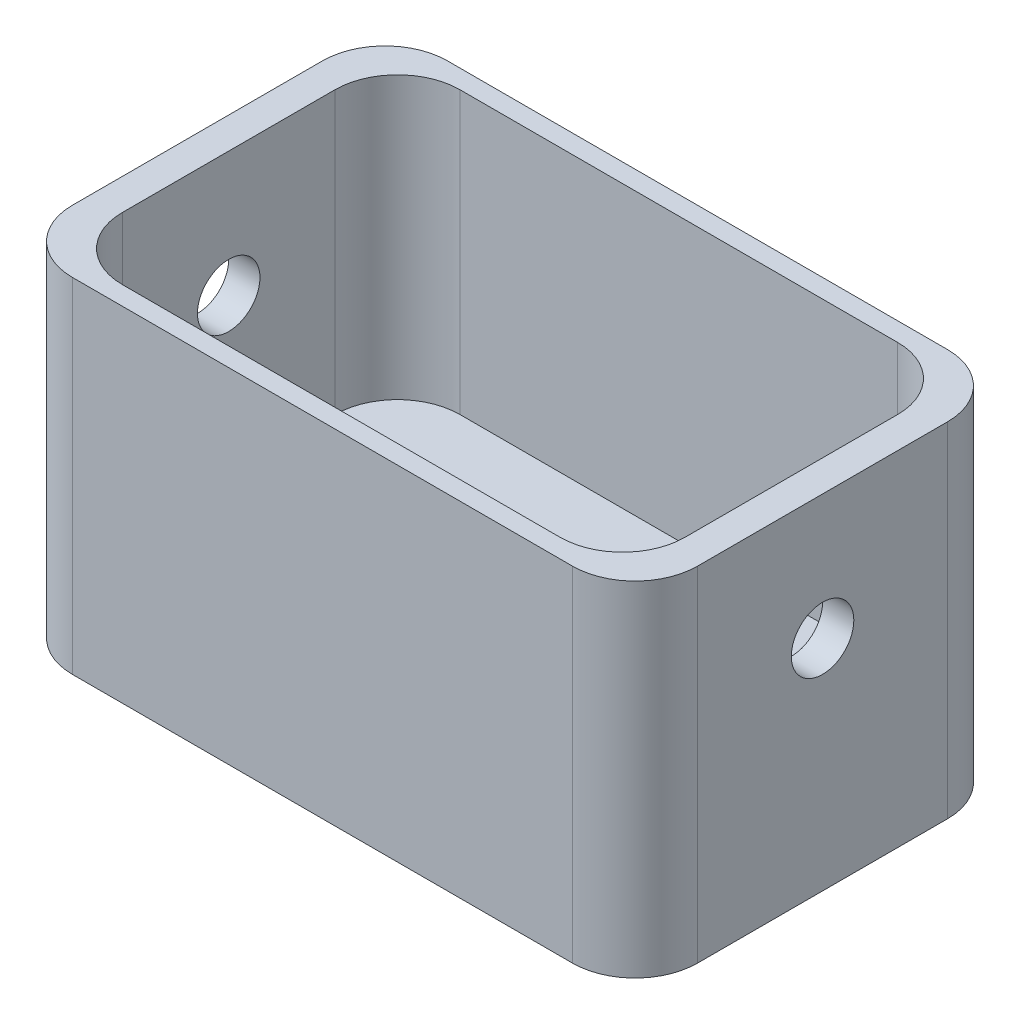
ISO-10303-21;
HEADER;
FILE_DESCRIPTION(('STEP AP214'),'2;1');
FILE_NAME('part.step','',(''),(''),'','','');
FILE_SCHEMA(('AUTOMOTIVE_DESIGN { 1 0 10303 214 1 1 1 1 }'));
ENDSEC;
DATA;
#1=APPLICATION_CONTEXT('core data for automotive mechanical design processes');
#2=APPLICATION_PROTOCOL_DEFINITION('international standard','automotive_design',2000,#1);
#3=PRODUCT_CONTEXT('',#1,'mechanical');
#4=PRODUCT('Part','Part','',(#3));
#5=PRODUCT_RELATED_PRODUCT_CATEGORY('part','',(#4));
#6=PRODUCT_DEFINITION_FORMATION('','',#4);
#7=PRODUCT_DEFINITION_CONTEXT('part definition',#1,'design');
#8=PRODUCT_DEFINITION('design','',#6,#7);
#9=PRODUCT_DEFINITION_SHAPE('','',#8);
#10=(LENGTH_UNIT() NAMED_UNIT(*) SI_UNIT(.MILLI.,.METRE.));
#11=(NAMED_UNIT(*) PLANE_ANGLE_UNIT() SI_UNIT($,.RADIAN.));
#12=(NAMED_UNIT(*) SI_UNIT($,.STERADIAN.) SOLID_ANGLE_UNIT());
#13=UNCERTAINTY_MEASURE_WITH_UNIT(LENGTH_MEASURE(1.E-05),#10,'distance_accuracy_value','');
#14=(GEOMETRIC_REPRESENTATION_CONTEXT(3) GLOBAL_UNCERTAINTY_ASSIGNED_CONTEXT((#13)) GLOBAL_UNIT_ASSIGNED_CONTEXT((#10,
#11,#12)) REPRESENTATION_CONTEXT('',''));
#15=CARTESIAN_POINT('',(0.,0.,0.));
#16=DIRECTION('',(0.,0.,1.));
#17=DIRECTION('',(1.,0.,0.));
#18=AXIS2_PLACEMENT_3D('',#15,#16,#17);
#19=CARTESIAN_POINT('',(-50.,55.,30.));
#20=DIRECTION('',(1.,0.,0.));
#21=DIRECTION('',(0.,0.,-1.));
#22=AXIS2_PLACEMENT_3D('',#19,#20,#21);
#23=PLANE('',#22);
#24=CARTESIAN_POINT('',(-50.,35.,0.));
#25=DIRECTION('',(1.,0.,0.));
#26=DIRECTION('',(0.,0.,-1.));
#27=AXIS2_PLACEMENT_3D('',#24,#25,#26);
#28=CIRCLE('',#27,5.);
#29=CARTESIAN_POINT('',(-50.,35.,-5.));
#30=VERTEX_POINT('',#29);
#31=EDGE_CURVE('E210',#30,#30,#28,.T.);
#32=ORIENTED_EDGE('',*,*,#31,.T.);
#33=EDGE_LOOP('',(#32));
#34=FACE_BOUND('',#33,.T.);
#35=DIRECTION('',(0.,0.,1.));
#36=VECTOR('',#35,1.);
#37=CARTESIAN_POINT('',(-50.,0.,30.));
#38=LINE('',#37,#36);
#39=CARTESIAN_POINT('',(-50.,0.,-20.));
#40=VERTEX_POINT('',#39);
#41=CARTESIAN_POINT('',(-50.,0.,20.));
#42=VERTEX_POINT('',#41);
#43=EDGE_CURVE('E196',#40,#42,#38,.T.);
#44=ORIENTED_EDGE('',*,*,#43,.T.);
#45=DIRECTION('',(0.,-1.,0.));
#46=VECTOR('',#45,1.);
#47=CARTESIAN_POINT('',(-50.,55.,20.));
#48=LINE('',#47,#46);
#49=CARTESIAN_POINT('',(-50.,55.,20.));
#50=VERTEX_POINT('',#49);
#51=EDGE_CURVE('E261',#42,#50,#48,.F.);
#52=ORIENTED_EDGE('',*,*,#51,.T.);
#53=DIRECTION('',(0.,0.,1.));
#54=VECTOR('',#53,1.);
#55=CARTESIAN_POINT('',(-50.,55.,30.));
#56=LINE('',#55,#54);
#57=CARTESIAN_POINT('',(-50.,55.,-20.));
#58=VERTEX_POINT('',#57);
#59=EDGE_CURVE('E185',#58,#50,#56,.T.);
#60=ORIENTED_EDGE('',*,*,#59,.F.);
#61=DIRECTION('',(0.,-1.,0.));
#62=VECTOR('',#61,1.);
#63=CARTESIAN_POINT('',(-50.,55.,-20.));
#64=LINE('',#63,#62);
#65=EDGE_CURVE('E258',#58,#40,#64,.T.);
#66=ORIENTED_EDGE('',*,*,#65,.T.);
#67=EDGE_LOOP('',(#44,#52,#60,#66));
#68=FACE_BOUND('',#67,.T.);
#69=ADVANCED_FACE('F33',(#34,#68),#23,.F.);
#70=CARTESIAN_POINT('',(50.,55.,30.));
#71=DIRECTION('',(0.,0.,-1.));
#72=DIRECTION('',(-1.,0.,0.));
#73=AXIS2_PLACEMENT_3D('',#70,#71,#72);
#74=PLANE('',#73);
#75=DIRECTION('',(1.,0.,0.));
#76=VECTOR('',#75,1.);
#77=CARTESIAN_POINT('',(50.,0.,30.));
#78=LINE('',#77,#76);
#79=CARTESIAN_POINT('',(-40.,0.,30.));
#80=VERTEX_POINT('',#79);
#81=CARTESIAN_POINT('',(40.,0.,30.));
#82=VERTEX_POINT('',#81);
#83=EDGE_CURVE('E199',#80,#82,#78,.T.);
#84=ORIENTED_EDGE('',*,*,#83,.T.);
#85=DIRECTION('',(0.,-1.,0.));
#86=VECTOR('',#85,1.);
#87=CARTESIAN_POINT('',(40.,55.,30.));
#88=LINE('',#87,#86);
#89=CARTESIAN_POINT('',(40.,55.,30.));
#90=VERTEX_POINT('',#89);
#91=EDGE_CURVE('E249',#82,#90,#88,.F.);
#92=ORIENTED_EDGE('',*,*,#91,.T.);
#93=DIRECTION('',(1.,0.,0.));
#94=VECTOR('',#93,1.);
#95=CARTESIAN_POINT('',(50.,55.,30.));
#96=LINE('',#95,#94);
#97=CARTESIAN_POINT('',(-40.,55.,30.));
#98=VERTEX_POINT('',#97);
#99=EDGE_CURVE('E188',#98,#90,#96,.T.);
#100=ORIENTED_EDGE('',*,*,#99,.F.);
#101=DIRECTION('',(0.,-1.,0.));
#102=VECTOR('',#101,1.);
#103=CARTESIAN_POINT('',(-40.,55.,30.));
#104=LINE('',#103,#102);
#105=EDGE_CURVE('E246',#98,#80,#104,.T.);
#106=ORIENTED_EDGE('',*,*,#105,.T.);
#107=EDGE_LOOP('',(#84,#92,#100,#106));
#108=FACE_BOUND('',#107,.T.);
#109=ADVANCED_FACE('F330',(#108),#74,.F.);
#110=CARTESIAN_POINT('',(50.,55.,30.));
#111=DIRECTION('',(-1.,0.,0.));
#112=DIRECTION('',(0.,0.,1.));
#113=AXIS2_PLACEMENT_3D('',#110,#111,#112);
#114=PLANE('',#113);
#115=CARTESIAN_POINT('',(50.,35.,0.));
#116=DIRECTION('',(1.,0.,0.));
#117=DIRECTION('',(0.,0.,-1.));
#118=AXIS2_PLACEMENT_3D('',#115,#116,#117);
#119=CIRCLE('',#118,5.);
#120=CARTESIAN_POINT('',(50.,35.,-5.));
#121=VERTEX_POINT('',#120);
#122=EDGE_CURVE('E294',#121,#121,#119,.T.);
#123=ORIENTED_EDGE('',*,*,#122,.F.);
#124=EDGE_LOOP('',(#123));
#125=FACE_BOUND('',#124,.T.);
#126=DIRECTION('',(0.,0.,-1.));
#127=VECTOR('',#126,1.);
#128=CARTESIAN_POINT('',(50.,55.,30.));
#129=LINE('',#128,#127);
#130=CARTESIAN_POINT('',(50.,55.,20.));
#131=VERTEX_POINT('',#130);
#132=CARTESIAN_POINT('',(50.,55.,-20.));
#133=VERTEX_POINT('',#132);
#134=EDGE_CURVE('E192',#131,#133,#129,.T.);
#135=ORIENTED_EDGE('',*,*,#134,.F.);
#136=DIRECTION('',(0.,-1.,0.));
#137=VECTOR('',#136,1.);
#138=CARTESIAN_POINT('',(50.,55.,20.));
#139=LINE('',#138,#137);
#140=CARTESIAN_POINT('',(50.,0.,20.));
#141=VERTEX_POINT('',#140);
#142=EDGE_CURVE('E235',#131,#141,#139,.T.);
#143=ORIENTED_EDGE('',*,*,#142,.T.);
#144=DIRECTION('',(0.,0.,-1.));
#145=VECTOR('',#144,1.);
#146=CARTESIAN_POINT('',(50.,0.,30.));
#147=LINE('',#146,#145);
#148=CARTESIAN_POINT('',(50.,0.,-20.));
#149=VERTEX_POINT('',#148);
#150=EDGE_CURVE('E203',#141,#149,#147,.T.);
#151=ORIENTED_EDGE('',*,*,#150,.T.);
#152=DIRECTION('',(0.,-1.,0.));
#153=VECTOR('',#152,1.);
#154=CARTESIAN_POINT('',(50.,55.,-20.));
#155=LINE('',#154,#153);
#156=EDGE_CURVE('E233',#149,#133,#155,.F.);
#157=ORIENTED_EDGE('',*,*,#156,.T.);
#158=EDGE_LOOP('',(#135,#143,#151,#157));
#159=FACE_BOUND('',#158,.T.);
#160=ADVANCED_FACE('F335',(#125,#159),#114,.F.);
#161=CARTESIAN_POINT('',(50.,55.,-30.));
#162=DIRECTION('',(0.,0.,1.));
#163=DIRECTION('',(1.,0.,0.));
#164=AXIS2_PLACEMENT_3D('',#161,#162,#163);
#165=PLANE('',#164);
#166=DIRECTION('',(-1.,0.,0.));
#167=VECTOR('',#166,1.);
#168=CARTESIAN_POINT('',(50.,0.,-30.));
#169=LINE('',#168,#167);
#170=CARTESIAN_POINT('',(40.,0.,-30.));
#171=VERTEX_POINT('',#170);
#172=CARTESIAN_POINT('',(-40.,0.,-30.));
#173=VERTEX_POINT('',#172);
#174=EDGE_CURVE('E189',#171,#173,#169,.T.);
#175=ORIENTED_EDGE('',*,*,#174,.T.);
#176=DIRECTION('',(0.,-1.,0.));
#177=VECTOR('',#176,1.);
#178=CARTESIAN_POINT('',(-40.,55.,-30.));
#179=LINE('',#178,#177);
#180=CARTESIAN_POINT('',(-40.,55.,-30.));
#181=VERTEX_POINT('',#180);
#182=EDGE_CURVE('E48',#173,#181,#179,.F.);
#183=ORIENTED_EDGE('',*,*,#182,.T.);
#184=DIRECTION('',(-1.,0.,0.));
#185=VECTOR('',#184,1.);
#186=CARTESIAN_POINT('',(50.,55.,-30.));
#187=LINE('',#186,#185);
#188=CARTESIAN_POINT('',(40.,55.,-30.));
#189=VERTEX_POINT('',#188);
#190=EDGE_CURVE('E194',#189,#181,#187,.T.);
#191=ORIENTED_EDGE('',*,*,#190,.F.);
#192=DIRECTION('',(0.,-1.,0.));
#193=VECTOR('',#192,1.);
#194=CARTESIAN_POINT('',(40.,55.,-30.));
#195=LINE('',#194,#193);
#196=EDGE_CURVE('E263',#189,#171,#195,.T.);
#197=ORIENTED_EDGE('',*,*,#196,.T.);
#198=EDGE_LOOP('',(#175,#183,#191,#197));
#199=FACE_BOUND('',#198,.T.);
#200=ADVANCED_FACE('F341',(#199),#165,.F.);
#201=CARTESIAN_POINT('',(0.,55.,0.));
#202=DIRECTION('',(0.,1.,0.));
#203=DIRECTION('',(0.,0.,1.));
#204=AXIS2_PLACEMENT_3D('',#201,#202,#203);
#205=PLANE('',#204);
#206=DIRECTION('',(0.,0.,1.));
#207=VECTOR('',#206,1.);
#208=CARTESIAN_POINT('',(-45.,55.,-27.));
#209=LINE('',#208,#207);
#210=CARTESIAN_POINT('',(-45.,55.,-17.));
#211=VERTEX_POINT('',#210);
#212=CARTESIAN_POINT('',(-45.,55.,17.));
#213=VERTEX_POINT('',#212);
#214=EDGE_CURVE('E173',#211,#213,#209,.T.);
#215=ORIENTED_EDGE('',*,*,#214,.F.);
#216=CARTESIAN_POINT('',(-35.,55.,-17.));
#217=DIRECTION('',(0.,1.,0.));
#218=DIRECTION('',(0.,0.,1.));
#219=AXIS2_PLACEMENT_3D('',#216,#217,#218);
#220=CIRCLE('',#219,10.);
#221=CARTESIAN_POINT('',(-35.,55.,-27.));
#222=VERTEX_POINT('',#221);
#223=EDGE_CURVE('E11',#211,#222,#220,.F.);
#224=ORIENTED_EDGE('',*,*,#223,.T.);
#225=DIRECTION('',(-1.,0.,0.));
#226=VECTOR('',#225,1.);
#227=CARTESIAN_POINT('',(45.,55.,-27.));
#228=LINE('',#227,#226);
#229=CARTESIAN_POINT('',(35.,55.,-27.));
#230=VERTEX_POINT('',#229);
#231=EDGE_CURVE('E176',#230,#222,#228,.T.);
#232=ORIENTED_EDGE('',*,*,#231,.F.);
#233=CARTESIAN_POINT('',(35.,55.,-17.));
#234=DIRECTION('',(0.,1.,0.));
#235=DIRECTION('',(0.,0.,1.));
#236=AXIS2_PLACEMENT_3D('',#233,#234,#235);
#237=CIRCLE('',#236,10.);
#238=CARTESIAN_POINT('',(45.,55.,-17.));
#239=VERTEX_POINT('',#238);
#240=EDGE_CURVE('E41',#230,#239,#237,.F.);
#241=ORIENTED_EDGE('',*,*,#240,.T.);
#242=DIRECTION('',(0.,0.,-1.));
#243=VECTOR('',#242,1.);
#244=CARTESIAN_POINT('',(45.,55.,-27.));
#245=LINE('',#244,#243);
#246=CARTESIAN_POINT('',(45.,55.,17.));
#247=VERTEX_POINT('',#246);
#248=EDGE_CURVE('E172',#247,#239,#245,.T.);
#249=ORIENTED_EDGE('',*,*,#248,.F.);
#250=CARTESIAN_POINT('',(35.,55.,17.));
#251=DIRECTION('',(0.,1.,0.));
#252=DIRECTION('',(0.,0.,1.));
#253=AXIS2_PLACEMENT_3D('',#250,#251,#252);
#254=CIRCLE('',#253,10.);
#255=CARTESIAN_POINT('',(35.,55.,27.));
#256=VERTEX_POINT('',#255);
#257=EDGE_CURVE('E157',#247,#256,#254,.F.);
#258=ORIENTED_EDGE('',*,*,#257,.T.);
#259=DIRECTION('',(1.,0.,0.));
#260=VECTOR('',#259,1.);
#261=CARTESIAN_POINT('',(45.,55.,27.));
#262=LINE('',#261,#260);
#263=CARTESIAN_POINT('',(-35.,55.,27.));
#264=VERTEX_POINT('',#263);
#265=EDGE_CURVE('E163',#264,#256,#262,.T.);
#266=ORIENTED_EDGE('',*,*,#265,.F.);
#267=CARTESIAN_POINT('',(-35.,55.,17.));
#268=DIRECTION('',(0.,1.,0.));
#269=DIRECTION('',(0.,0.,1.));
#270=AXIS2_PLACEMENT_3D('',#267,#268,#269);
#271=CIRCLE('',#270,10.);
#272=EDGE_CURVE('E147',#264,#213,#271,.F.);
#273=ORIENTED_EDGE('',*,*,#272,.T.);
#274=EDGE_LOOP('',(#215,#224,#232,#241,#249,#258,#266,#273));
#275=FACE_BOUND('',#274,.T.);
#276=ORIENTED_EDGE('',*,*,#99,.T.);
#277=CARTESIAN_POINT('',(40.,55.,20.));
#278=DIRECTION('',(0.,1.,0.));
#279=DIRECTION('',(0.,0.,1.));
#280=AXIS2_PLACEMENT_3D('',#277,#278,#279);
#281=CIRCLE('',#280,10.);
#282=EDGE_CURVE('E256',#90,#131,#281,.T.);
#283=ORIENTED_EDGE('',*,*,#282,.T.);
#284=ORIENTED_EDGE('',*,*,#134,.T.);
#285=CARTESIAN_POINT('',(40.,55.,-20.));
#286=DIRECTION('',(0.,1.,0.));
#287=DIRECTION('',(0.,0.,1.));
#288=AXIS2_PLACEMENT_3D('',#285,#286,#287);
#289=CIRCLE('',#288,10.);
#290=EDGE_CURVE('E55',#133,#189,#289,.T.);
#291=ORIENTED_EDGE('',*,*,#290,.T.);
#292=ORIENTED_EDGE('',*,*,#190,.T.);
#293=CARTESIAN_POINT('',(-40.,55.,-20.));
#294=DIRECTION('',(0.,1.,0.));
#295=DIRECTION('',(0.,0.,1.));
#296=AXIS2_PLACEMENT_3D('',#293,#294,#295);
#297=CIRCLE('',#296,10.);
#298=EDGE_CURVE('E252',#181,#58,#297,.T.);
#299=ORIENTED_EDGE('',*,*,#298,.T.);
#300=ORIENTED_EDGE('',*,*,#59,.T.);
#301=CARTESIAN_POINT('',(-40.,55.,20.));
#302=DIRECTION('',(0.,1.,0.));
#303=DIRECTION('',(0.,0.,1.));
#304=AXIS2_PLACEMENT_3D('',#301,#302,#303);
#305=CIRCLE('',#304,10.);
#306=EDGE_CURVE('E254',#50,#98,#305,.T.);
#307=ORIENTED_EDGE('',*,*,#306,.T.);
#308=EDGE_LOOP('',(#276,#283,#284,#291,#292,#299,#300,#307));
#309=FACE_BOUND('',#308,.T.);
#310=ADVANCED_FACE('F170',(#275,#309),#205,.T.);
#311=CARTESIAN_POINT('',(0.,0.,0.));
#312=DIRECTION('',(0.,1.,0.));
#313=DIRECTION('',(0.,0.,1.));
#314=AXIS2_PLACEMENT_3D('',#311,#312,#313);
#315=PLANE('',#314);
#316=ORIENTED_EDGE('',*,*,#150,.F.);
#317=CARTESIAN_POINT('',(40.,0.,20.));
#318=DIRECTION('',(0.,1.,0.));
#319=DIRECTION('',(0.,0.,1.));
#320=AXIS2_PLACEMENT_3D('',#317,#318,#319);
#321=CIRCLE('',#320,10.);
#322=EDGE_CURVE('E244',#141,#82,#321,.F.);
#323=ORIENTED_EDGE('',*,*,#322,.T.);
#324=ORIENTED_EDGE('',*,*,#83,.F.);
#325=CARTESIAN_POINT('',(-40.,0.,20.));
#326=DIRECTION('',(0.,1.,0.));
#327=DIRECTION('',(0.,0.,1.));
#328=AXIS2_PLACEMENT_3D('',#325,#326,#327);
#329=CIRCLE('',#328,10.);
#330=EDGE_CURVE('E242',#80,#42,#329,.F.);
#331=ORIENTED_EDGE('',*,*,#330,.T.);
#332=ORIENTED_EDGE('',*,*,#43,.F.);
#333=CARTESIAN_POINT('',(-40.,0.,-20.));
#334=DIRECTION('',(0.,1.,0.));
#335=DIRECTION('',(0.,0.,1.));
#336=AXIS2_PLACEMENT_3D('',#333,#334,#335);
#337=CIRCLE('',#336,10.);
#338=EDGE_CURVE('E240',#40,#173,#337,.F.);
#339=ORIENTED_EDGE('',*,*,#338,.T.);
#340=ORIENTED_EDGE('',*,*,#174,.F.);
#341=CARTESIAN_POINT('',(40.,0.,-20.));
#342=DIRECTION('',(0.,1.,0.));
#343=DIRECTION('',(0.,0.,1.));
#344=AXIS2_PLACEMENT_3D('',#341,#342,#343);
#345=CIRCLE('',#344,10.);
#346=EDGE_CURVE('E238',#171,#149,#345,.F.);
#347=ORIENTED_EDGE('',*,*,#346,.T.);
#348=EDGE_LOOP('',(#316,#323,#324,#331,#332,#339,#340,#347));
#349=FACE_BOUND('',#348,.T.);
#350=ADVANCED_FACE('F312',(#349),#315,.F.);
#351=CARTESIAN_POINT('',(-45.,10.,-27.));
#352=DIRECTION('',(-1.,0.,0.));
#353=DIRECTION('',(0.,0.,1.));
#354=AXIS2_PLACEMENT_3D('',#351,#352,#353);
#355=PLANE('',#354);
#356=CARTESIAN_POINT('',(-45.,35.,0.));
#357=DIRECTION('',(-1.,0.,0.));
#358=DIRECTION('',(0.,0.,1.));
#359=AXIS2_PLACEMENT_3D('',#356,#357,#358);
#360=CIRCLE('',#359,5.);
#361=CARTESIAN_POINT('',(-45.,35.,5.));
#362=VERTEX_POINT('',#361);
#363=EDGE_CURVE('E178',#362,#362,#360,.T.);
#364=ORIENTED_EDGE('',*,*,#363,.T.);
#365=EDGE_LOOP('',(#364));
#366=FACE_BOUND('',#365,.T.);
#367=ORIENTED_EDGE('',*,*,#214,.T.);
#368=DIRECTION('',(0.,1.,0.));
#369=VECTOR('',#368,1.);
#370=CARTESIAN_POINT('',(-45.,10.,17.));
#371=LINE('',#370,#369);
#372=CARTESIAN_POINT('',(-45.,10.,17.));
#373=VERTEX_POINT('',#372);
#374=EDGE_CURVE('E152',#213,#373,#371,.F.);
#375=ORIENTED_EDGE('',*,*,#374,.T.);
#376=DIRECTION('',(0.,0.,1.));
#377=VECTOR('',#376,1.);
#378=CARTESIAN_POINT('',(-45.,10.,-27.));
#379=LINE('',#378,#377);
#380=CARTESIAN_POINT('',(-45.,10.,-17.));
#381=VERTEX_POINT('',#380);
#382=EDGE_CURVE('E184',#381,#373,#379,.T.);
#383=ORIENTED_EDGE('',*,*,#382,.F.);
#384=DIRECTION('',(0.,1.,0.));
#385=VECTOR('',#384,1.);
#386=CARTESIAN_POINT('',(-45.,55.,-17.));
#387=LINE('',#386,#385);
#388=EDGE_CURVE('E167',#381,#211,#387,.T.);
#389=ORIENTED_EDGE('',*,*,#388,.T.);
#390=EDGE_LOOP('',(#367,#375,#383,#389));
#391=FACE_BOUND('',#390,.T.);
#392=ADVANCED_FACE('F309',(#366,#391),#355,.F.);
#393=CARTESIAN_POINT('',(45.,10.,-27.));
#394=DIRECTION('',(0.,0.,-1.));
#395=DIRECTION('',(-1.,0.,0.));
#396=AXIS2_PLACEMENT_3D('',#393,#394,#395);
#397=PLANE('',#396);
#398=DIRECTION('',(-1.,0.,0.));
#399=VECTOR('',#398,1.);
#400=CARTESIAN_POINT('',(45.,10.,-27.));
#401=LINE('',#400,#399);
#402=CARTESIAN_POINT('',(35.,10.,-27.));
#403=VERTEX_POINT('',#402);
#404=CARTESIAN_POINT('',(-35.,10.,-27.));
#405=VERTEX_POINT('',#404);
#406=EDGE_CURVE('E200',#403,#405,#401,.T.);
#407=ORIENTED_EDGE('',*,*,#406,.F.);
#408=DIRECTION('',(0.,1.,0.));
#409=VECTOR('',#408,1.);
#410=CARTESIAN_POINT('',(35.,55.,-27.));
#411=LINE('',#410,#409);
#412=EDGE_CURVE('E230',#403,#230,#411,.T.);
#413=ORIENTED_EDGE('',*,*,#412,.T.);
#414=ORIENTED_EDGE('',*,*,#231,.T.);
#415=DIRECTION('',(0.,1.,0.));
#416=VECTOR('',#415,1.);
#417=CARTESIAN_POINT('',(-35.,10.,-27.));
#418=LINE('',#417,#416);
#419=EDGE_CURVE('E228',#222,#405,#418,.F.);
#420=ORIENTED_EDGE('',*,*,#419,.T.);
#421=EDGE_LOOP('',(#407,#413,#414,#420));
#422=FACE_BOUND('',#421,.T.);
#423=ADVANCED_FACE('F286',(#422),#397,.F.);
#424=CARTESIAN_POINT('',(45.,10.,-27.));
#425=DIRECTION('',(1.,0.,0.));
#426=DIRECTION('',(0.,0.,-1.));
#427=AXIS2_PLACEMENT_3D('',#424,#425,#426);
#428=PLANE('',#427);
#429=CARTESIAN_POINT('',(45.,35.,0.));
#430=DIRECTION('',(1.,0.,0.));
#431=DIRECTION('',(0.,0.,-1.));
#432=AXIS2_PLACEMENT_3D('',#429,#430,#431);
#433=CIRCLE('',#432,5.);
#434=CARTESIAN_POINT('',(45.,35.,-5.));
#435=VERTEX_POINT('',#434);
#436=EDGE_CURVE('E207',#435,#435,#433,.T.);
#437=ORIENTED_EDGE('',*,*,#436,.T.);
#438=EDGE_LOOP('',(#437));
#439=FACE_BOUND('',#438,.T.);
#440=DIRECTION('',(0.,0.,-1.));
#441=VECTOR('',#440,1.);
#442=CARTESIAN_POINT('',(45.,10.,-27.));
#443=LINE('',#442,#441);
#444=CARTESIAN_POINT('',(45.,10.,17.));
#445=VERTEX_POINT('',#444);
#446=CARTESIAN_POINT('',(45.,10.,-17.));
#447=VERTEX_POINT('',#446);
#448=EDGE_CURVE('E284',#445,#447,#443,.T.);
#449=ORIENTED_EDGE('',*,*,#448,.F.);
#450=DIRECTION('',(0.,1.,0.));
#451=VECTOR('',#450,1.);
#452=CARTESIAN_POINT('',(45.,55.,17.));
#453=LINE('',#452,#451);
#454=EDGE_CURVE('E225',#445,#247,#453,.T.);
#455=ORIENTED_EDGE('',*,*,#454,.T.);
#456=ORIENTED_EDGE('',*,*,#248,.T.);
#457=DIRECTION('',(0.,1.,0.));
#458=VECTOR('',#457,1.);
#459=CARTESIAN_POINT('',(45.,10.,-17.));
#460=LINE('',#459,#458);
#461=EDGE_CURVE('E223',#239,#447,#460,.F.);
#462=ORIENTED_EDGE('',*,*,#461,.T.);
#463=EDGE_LOOP('',(#449,#455,#456,#462));
#464=FACE_BOUND('',#463,.T.);
#465=ADVANCED_FACE('F273',(#439,#464),#428,.F.);
#466=CARTESIAN_POINT('',(45.,10.,27.));
#467=DIRECTION('',(0.,0.,1.));
#468=DIRECTION('',(1.,0.,0.));
#469=AXIS2_PLACEMENT_3D('',#466,#467,#468);
#470=PLANE('',#469);
#471=DIRECTION('',(1.,0.,0.));
#472=VECTOR('',#471,1.);
#473=CARTESIAN_POINT('',(45.,10.,27.));
#474=LINE('',#473,#472);
#475=CARTESIAN_POINT('',(-35.,10.,27.));
#476=VERTEX_POINT('',#475);
#477=CARTESIAN_POINT('',(35.,10.,27.));
#478=VERTEX_POINT('',#477);
#479=EDGE_CURVE('E166',#476,#478,#474,.T.);
#480=ORIENTED_EDGE('',*,*,#479,.F.);
#481=DIRECTION('',(0.,1.,0.));
#482=VECTOR('',#481,1.);
#483=CARTESIAN_POINT('',(-35.,55.,27.));
#484=LINE('',#483,#482);
#485=EDGE_CURVE('E151',#476,#264,#484,.T.);
#486=ORIENTED_EDGE('',*,*,#485,.T.);
#487=ORIENTED_EDGE('',*,*,#265,.T.);
#488=DIRECTION('',(0.,1.,0.));
#489=VECTOR('',#488,1.);
#490=CARTESIAN_POINT('',(35.,10.,27.));
#491=LINE('',#490,#489);
#492=EDGE_CURVE('E168',#256,#478,#491,.F.);
#493=ORIENTED_EDGE('',*,*,#492,.T.);
#494=EDGE_LOOP('',(#480,#486,#487,#493));
#495=FACE_BOUND('',#494,.T.);
#496=ADVANCED_FACE('F162',(#495),#470,.F.);
#497=CARTESIAN_POINT('',(0.,10.,0.));
#498=DIRECTION('',(0.,-1.,0.));
#499=DIRECTION('',(0.,0.,-1.));
#500=AXIS2_PLACEMENT_3D('',#497,#498,#499);
#501=PLANE('',#500);
#502=ORIENTED_EDGE('',*,*,#382,.T.);
#503=CARTESIAN_POINT('',(-35.,10.,17.));
#504=DIRECTION('',(0.,-1.,0.));
#505=DIRECTION('',(0.,0.,-1.));
#506=AXIS2_PLACEMENT_3D('',#503,#504,#505);
#507=CIRCLE('',#506,10.);
#508=EDGE_CURVE('E221',#373,#476,#507,.F.);
#509=ORIENTED_EDGE('',*,*,#508,.T.);
#510=ORIENTED_EDGE('',*,*,#479,.T.);
#511=CARTESIAN_POINT('',(35.,10.,17.));
#512=DIRECTION('',(0.,-1.,0.));
#513=DIRECTION('',(0.,0.,-1.));
#514=AXIS2_PLACEMENT_3D('',#511,#512,#513);
#515=CIRCLE('',#514,10.);
#516=EDGE_CURVE('E219',#478,#445,#515,.F.);
#517=ORIENTED_EDGE('',*,*,#516,.T.);
#518=ORIENTED_EDGE('',*,*,#448,.T.);
#519=CARTESIAN_POINT('',(35.,10.,-17.));
#520=DIRECTION('',(0.,-1.,0.));
#521=DIRECTION('',(0.,0.,-1.));
#522=AXIS2_PLACEMENT_3D('',#519,#520,#521);
#523=CIRCLE('',#522,10.);
#524=EDGE_CURVE('E217',#447,#403,#523,.F.);
#525=ORIENTED_EDGE('',*,*,#524,.T.);
#526=ORIENTED_EDGE('',*,*,#406,.T.);
#527=CARTESIAN_POINT('',(-35.,10.,-17.));
#528=DIRECTION('',(0.,-1.,0.));
#529=DIRECTION('',(0.,0.,-1.));
#530=AXIS2_PLACEMENT_3D('',#527,#528,#529);
#531=CIRCLE('',#530,10.);
#532=EDGE_CURVE('E215',#405,#381,#531,.F.);
#533=ORIENTED_EDGE('',*,*,#532,.T.);
#534=EDGE_LOOP('',(#502,#509,#510,#517,#518,#525,#526,#533));
#535=FACE_BOUND('',#534,.T.);
#536=ADVANCED_FACE('F282',(#535),#501,.F.);
#537=CARTESIAN_POINT('',(-50.,35.,0.));
#538=DIRECTION('',(1.,0.,0.));
#539=DIRECTION('',(0.,0.,-1.));
#540=AXIS2_PLACEMENT_3D('',#537,#538,#539);
#541=CYLINDRICAL_SURFACE('',#540,5.);
#542=ORIENTED_EDGE('',*,*,#122,.T.);
#543=EDGE_LOOP('',(#542));
#544=FACE_BOUND('',#543,.T.);
#545=ORIENTED_EDGE('',*,*,#436,.F.);
#546=EDGE_LOOP('',(#545));
#547=FACE_BOUND('',#546,.T.);
#548=ADVANCED_FACE('F305',(#544,#547),#541,.F.);
#549=ORIENTED_EDGE('',*,*,#31,.F.);
#550=EDGE_LOOP('',(#549));
#551=FACE_BOUND('',#550,.T.);
#552=ORIENTED_EDGE('',*,*,#363,.F.);
#553=EDGE_LOOP('',(#552));
#554=FACE_BOUND('',#553,.T.);
#555=ADVANCED_FACE('F302',(#551,#554),#541,.F.);
#556=CARTESIAN_POINT('',(-35.,10.,17.));
#557=DIRECTION('',(0.,-1.,0.));
#558=DIRECTION('',(0.,0.,-1.));
#559=AXIS2_PLACEMENT_3D('',#556,#557,#558);
#560=CYLINDRICAL_SURFACE('',#559,10.);
#561=ORIENTED_EDGE('',*,*,#508,.F.);
#562=ORIENTED_EDGE('',*,*,#374,.F.);
#563=ORIENTED_EDGE('',*,*,#272,.F.);
#564=ORIENTED_EDGE('',*,*,#485,.F.);
#565=EDGE_LOOP('',(#561,#562,#563,#564));
#566=FACE_BOUND('',#565,.T.);
#567=ADVANCED_FACE('F150',(#566),#560,.F.);
#568=CARTESIAN_POINT('',(35.,10.,17.));
#569=DIRECTION('',(0.,-1.,0.));
#570=DIRECTION('',(0.,0.,-1.));
#571=AXIS2_PLACEMENT_3D('',#568,#569,#570);
#572=CYLINDRICAL_SURFACE('',#571,10.);
#573=ORIENTED_EDGE('',*,*,#516,.F.);
#574=ORIENTED_EDGE('',*,*,#492,.F.);
#575=ORIENTED_EDGE('',*,*,#257,.F.);
#576=ORIENTED_EDGE('',*,*,#454,.F.);
#577=EDGE_LOOP('',(#573,#574,#575,#576));
#578=FACE_BOUND('',#577,.T.);
#579=ADVANCED_FACE('F320',(#578),#572,.F.);
#580=CARTESIAN_POINT('',(35.,10.,-17.));
#581=DIRECTION('',(0.,-1.,0.));
#582=DIRECTION('',(0.,0.,-1.));
#583=AXIS2_PLACEMENT_3D('',#580,#581,#582);
#584=CYLINDRICAL_SURFACE('',#583,10.);
#585=ORIENTED_EDGE('',*,*,#524,.F.);
#586=ORIENTED_EDGE('',*,*,#461,.F.);
#587=ORIENTED_EDGE('',*,*,#240,.F.);
#588=ORIENTED_EDGE('',*,*,#412,.F.);
#589=EDGE_LOOP('',(#585,#586,#587,#588));
#590=FACE_BOUND('',#589,.T.);
#591=ADVANCED_FACE('F277',(#590),#584,.F.);
#592=CARTESIAN_POINT('',(-35.,10.,-17.));
#593=DIRECTION('',(0.,-1.,0.));
#594=DIRECTION('',(0.,0.,-1.));
#595=AXIS2_PLACEMENT_3D('',#592,#593,#594);
#596=CYLINDRICAL_SURFACE('',#595,10.);
#597=ORIENTED_EDGE('',*,*,#532,.F.);
#598=ORIENTED_EDGE('',*,*,#419,.F.);
#599=ORIENTED_EDGE('',*,*,#223,.F.);
#600=ORIENTED_EDGE('',*,*,#388,.F.);
#601=EDGE_LOOP('',(#597,#598,#599,#600));
#602=FACE_BOUND('',#601,.T.);
#603=ADVANCED_FACE('F317',(#602),#596,.F.);
#604=CARTESIAN_POINT('',(40.,55.,20.));
#605=DIRECTION('',(0.,-1.,0.));
#606=DIRECTION('',(0.,0.,-1.));
#607=AXIS2_PLACEMENT_3D('',#604,#605,#606);
#608=CYLINDRICAL_SURFACE('',#607,10.);
#609=ORIENTED_EDGE('',*,*,#282,.F.);
#610=ORIENTED_EDGE('',*,*,#91,.F.);
#611=ORIENTED_EDGE('',*,*,#322,.F.);
#612=ORIENTED_EDGE('',*,*,#142,.F.);
#613=EDGE_LOOP('',(#609,#610,#611,#612));
#614=FACE_BOUND('',#613,.T.);
#615=ADVANCED_FACE('F374',(#614),#608,.T.);
#616=CARTESIAN_POINT('',(-40.,55.,20.));
#617=DIRECTION('',(0.,-1.,0.));
#618=DIRECTION('',(0.,0.,-1.));
#619=AXIS2_PLACEMENT_3D('',#616,#617,#618);
#620=CYLINDRICAL_SURFACE('',#619,10.);
#621=ORIENTED_EDGE('',*,*,#306,.F.);
#622=ORIENTED_EDGE('',*,*,#51,.F.);
#623=ORIENTED_EDGE('',*,*,#330,.F.);
#624=ORIENTED_EDGE('',*,*,#105,.F.);
#625=EDGE_LOOP('',(#621,#622,#623,#624));
#626=FACE_BOUND('',#625,.T.);
#627=ADVANCED_FACE('F381',(#626),#620,.T.);
#628=CARTESIAN_POINT('',(-40.,55.,-20.));
#629=DIRECTION('',(0.,-1.,0.));
#630=DIRECTION('',(0.,0.,-1.));
#631=AXIS2_PLACEMENT_3D('',#628,#629,#630);
#632=CYLINDRICAL_SURFACE('',#631,10.);
#633=ORIENTED_EDGE('',*,*,#298,.F.);
#634=ORIENTED_EDGE('',*,*,#182,.F.);
#635=ORIENTED_EDGE('',*,*,#338,.F.);
#636=ORIENTED_EDGE('',*,*,#65,.F.);
#637=EDGE_LOOP('',(#633,#634,#635,#636));
#638=FACE_BOUND('',#637,.T.);
#639=ADVANCED_FACE('F388',(#638),#632,.T.);
#640=CARTESIAN_POINT('',(40.,55.,-20.));
#641=DIRECTION('',(0.,-1.,0.));
#642=DIRECTION('',(0.,0.,-1.));
#643=AXIS2_PLACEMENT_3D('',#640,#641,#642);
#644=CYLINDRICAL_SURFACE('',#643,10.);
#645=ORIENTED_EDGE('',*,*,#290,.F.);
#646=ORIENTED_EDGE('',*,*,#156,.F.);
#647=ORIENTED_EDGE('',*,*,#346,.F.);
#648=ORIENTED_EDGE('',*,*,#196,.F.);
#649=EDGE_LOOP('',(#645,#646,#647,#648));
#650=FACE_BOUND('',#649,.T.);
#651=ADVANCED_FACE('F35',(#650),#644,.T.);
#652=CLOSED_SHELL('',(#69,#109,#160,#200,#310,#350,#392,#423,#465,#496,#536,#548,#555,#567,#579,
#591,#603,#615,#627,#639,#651));
#653=MANIFOLD_SOLID_BREP('B2',#652);
#654=ADVANCED_BREP_SHAPE_REPRESENTATION('',(#18,#653),#14);
#655=SHAPE_DEFINITION_REPRESENTATION(#9,#654);
ENDSEC;
END-ISO-10303-21;
